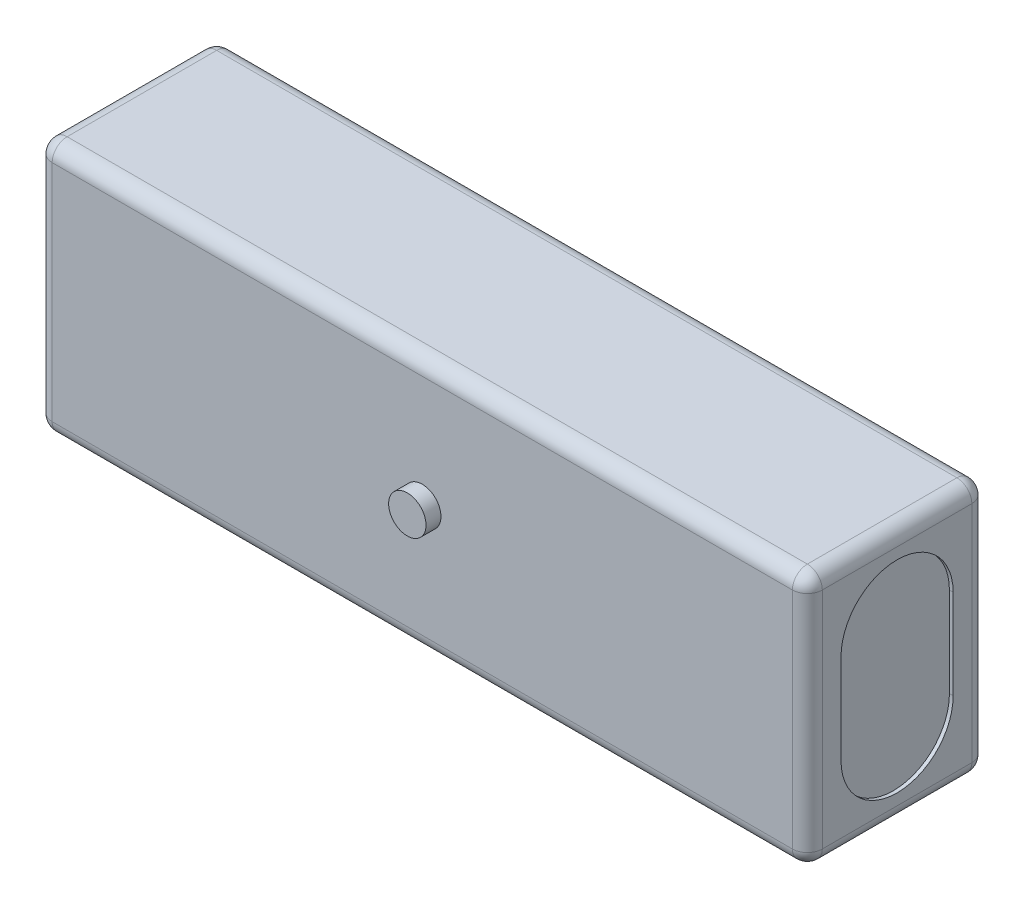
ISO-10303-21;
HEADER;
FILE_DESCRIPTION(('STEP AP214'),'2;1');
FILE_NAME('part.step','',(''),(''),'','','');
FILE_SCHEMA(('AUTOMOTIVE_DESIGN { 1 0 10303 214 1 1 1 1 }'));
ENDSEC;
DATA;
#1=APPLICATION_CONTEXT('core data for automotive mechanical design processes');
#2=APPLICATION_PROTOCOL_DEFINITION('international standard','automotive_design',2000,#1);
#3=PRODUCT_CONTEXT('',#1,'mechanical');
#4=PRODUCT('Part','Part','',(#3));
#5=PRODUCT_RELATED_PRODUCT_CATEGORY('part','',(#4));
#6=PRODUCT_DEFINITION_FORMATION('','',#4);
#7=PRODUCT_DEFINITION_CONTEXT('part definition',#1,'design');
#8=PRODUCT_DEFINITION('design','',#6,#7);
#9=PRODUCT_DEFINITION_SHAPE('','',#8);
#10=(LENGTH_UNIT() NAMED_UNIT(*) SI_UNIT(.MILLI.,.METRE.));
#11=(NAMED_UNIT(*) PLANE_ANGLE_UNIT() SI_UNIT($,.RADIAN.));
#12=(NAMED_UNIT(*) SI_UNIT($,.STERADIAN.) SOLID_ANGLE_UNIT());
#13=UNCERTAINTY_MEASURE_WITH_UNIT(LENGTH_MEASURE(1.E-05),#10,'distance_accuracy_value','');
#14=(GEOMETRIC_REPRESENTATION_CONTEXT(3) GLOBAL_UNCERTAINTY_ASSIGNED_CONTEXT((#13)) GLOBAL_UNIT_ASSIGNED_CONTEXT((#10,
#11,#12)) REPRESENTATION_CONTEXT('',''));
#15=CARTESIAN_POINT('',(0.,0.,0.));
#16=DIRECTION('',(0.,0.,1.));
#17=DIRECTION('',(1.,0.,0.));
#18=AXIS2_PLACEMENT_3D('',#15,#16,#17);
#19=CARTESIAN_POINT('',(-51.5,17.,24.));
#20=DIRECTION('',(1.,0.,0.));
#21=DIRECTION('',(0.,1.,0.));
#22=AXIS2_PLACEMENT_3D('',#19,#20,#21);
#23=PLANE('',#22);
#24=DIRECTION('',(0.,-1.,0.));
#25=VECTOR('',#24,1.);
#26=CARTESIAN_POINT('',(-51.5,17.,2.));
#27=LINE('',#26,#25);
#28=CARTESIAN_POINT('',(-51.5,15.,2.));
#29=VERTEX_POINT('',#28);
#30=CARTESIAN_POINT('',(-51.5,-15.,2.));
#31=VERTEX_POINT('',#30);
#32=EDGE_CURVE('E299',#29,#31,#27,.T.);
#33=ORIENTED_EDGE('',*,*,#32,.T.);
#34=DIRECTION('',(0.,0.,-1.));
#35=VECTOR('',#34,1.);
#36=CARTESIAN_POINT('',(-51.5,-15.,24.));
#37=LINE('',#36,#35);
#38=CARTESIAN_POINT('',(-51.5,-15.,22.));
#39=VERTEX_POINT('',#38);
#40=EDGE_CURVE('E302',#31,#39,#37,.F.);
#41=ORIENTED_EDGE('',*,*,#40,.T.);
#42=DIRECTION('',(0.,-1.,0.));
#43=VECTOR('',#42,1.);
#44=CARTESIAN_POINT('',(-51.5,17.,22.));
#45=LINE('',#44,#43);
#46=CARTESIAN_POINT('',(-51.5,15.,22.));
#47=VERTEX_POINT('',#46);
#48=EDGE_CURVE('E293',#39,#47,#45,.F.);
#49=ORIENTED_EDGE('',*,*,#48,.T.);
#50=DIRECTION('',(0.,0.,-1.));
#51=VECTOR('',#50,1.);
#52=CARTESIAN_POINT('',(-51.5,15.,24.));
#53=LINE('',#52,#51);
#54=EDGE_CURVE('E296',#47,#29,#53,.T.);
#55=ORIENTED_EDGE('',*,*,#54,.T.);
#56=EDGE_LOOP('',(#33,#41,#49,#55));
#57=FACE_BOUND('',#56,.T.);
#58=CARTESIAN_POINT('',(-51.5,6.,12.));
#59=DIRECTION('',(1.,0.,0.));
#60=DIRECTION('',(0.,1.,0.));
#61=AXIS2_PLACEMENT_3D('',#58,#59,#60);
#62=CIRCLE('',#61,7.5);
#63=CARTESIAN_POINT('',(-51.5,6.00000000000001,4.5));
#64=VERTEX_POINT('',#63);
#65=CARTESIAN_POINT('',(-51.5,6.,19.5));
#66=VERTEX_POINT('',#65);
#67=EDGE_CURVE('E200',#64,#66,#62,.T.);
#68=ORIENTED_EDGE('',*,*,#67,.T.);
#69=DIRECTION('',(0.,-1.,0.));
#70=VECTOR('',#69,1.);
#71=CARTESIAN_POINT('',(-51.5,6.,19.5));
#72=LINE('',#71,#70);
#73=CARTESIAN_POINT('',(-51.5,-6.,19.5));
#74=VERTEX_POINT('',#73);
#75=EDGE_CURVE('E206',#66,#74,#72,.T.);
#76=ORIENTED_EDGE('',*,*,#75,.T.);
#77=CARTESIAN_POINT('',(-51.5,-6.,12.));
#78=DIRECTION('',(1.,0.,0.));
#79=DIRECTION('',(0.,1.,0.));
#80=AXIS2_PLACEMENT_3D('',#77,#78,#79);
#81=CIRCLE('',#80,7.5);
#82=CARTESIAN_POINT('',(-51.5,-6.,4.5));
#83=VERTEX_POINT('',#82);
#84=EDGE_CURVE('E210',#74,#83,#81,.T.);
#85=ORIENTED_EDGE('',*,*,#84,.T.);
#86=DIRECTION('',(0.,1.,0.));
#87=VECTOR('',#86,1.);
#88=CARTESIAN_POINT('',(-51.5,6.00000000000001,4.5));
#89=LINE('',#88,#87);
#90=EDGE_CURVE('E222',#83,#64,#89,.T.);
#91=ORIENTED_EDGE('',*,*,#90,.T.);
#92=EDGE_LOOP('',(#68,#76,#85,#91));
#93=FACE_BOUND('',#92,.T.);
#94=ADVANCED_FACE('F41',(#57,#93),#23,.F.);
#95=CARTESIAN_POINT('',(51.5,17.,24.));
#96=DIRECTION('',(-1.,0.,0.));
#97=DIRECTION('',(0.,-1.,0.));
#98=AXIS2_PLACEMENT_3D('',#95,#96,#97);
#99=PLANE('',#98);
#100=DIRECTION('',(0.,1.,0.));
#101=VECTOR('',#100,1.);
#102=CARTESIAN_POINT('',(51.5,-17.,22.));
#103=LINE('',#102,#101);
#104=CARTESIAN_POINT('',(51.5,15.,22.));
#105=VERTEX_POINT('',#104);
#106=CARTESIAN_POINT('',(51.5,-15.,22.));
#107=VERTEX_POINT('',#106);
#108=EDGE_CURVE('E306',#105,#107,#103,.F.);
#109=ORIENTED_EDGE('',*,*,#108,.T.);
#110=DIRECTION('',(0.,0.,-1.));
#111=VECTOR('',#110,1.);
#112=CARTESIAN_POINT('',(51.5,-15.,24.));
#113=LINE('',#112,#111);
#114=CARTESIAN_POINT('',(51.5,-15.,2.));
#115=VERTEX_POINT('',#114);
#116=EDGE_CURVE('E315',#107,#115,#113,.T.);
#117=ORIENTED_EDGE('',*,*,#116,.T.);
#118=DIRECTION('',(0.,1.,0.));
#119=VECTOR('',#118,1.);
#120=CARTESIAN_POINT('',(51.5,17.,2.));
#121=LINE('',#120,#119);
#122=CARTESIAN_POINT('',(51.5,15.,2.));
#123=VERTEX_POINT('',#122);
#124=EDGE_CURVE('E312',#115,#123,#121,.T.);
#125=ORIENTED_EDGE('',*,*,#124,.T.);
#126=DIRECTION('',(0.,0.,-1.));
#127=VECTOR('',#126,1.);
#128=CARTESIAN_POINT('',(51.5,15.,24.));
#129=LINE('',#128,#127);
#130=EDGE_CURVE('E309',#123,#105,#129,.F.);
#131=ORIENTED_EDGE('',*,*,#130,.T.);
#132=EDGE_LOOP('',(#109,#117,#125,#131));
#133=FACE_BOUND('',#132,.T.);
#134=DIRECTION('',(0.,-1.,0.));
#135=VECTOR('',#134,1.);
#136=CARTESIAN_POINT('',(51.5,6.,19.5));
#137=LINE('',#136,#135);
#138=CARTESIAN_POINT('',(51.5,6.,19.5));
#139=VERTEX_POINT('',#138);
#140=CARTESIAN_POINT('',(51.5,-6.,19.5));
#141=VERTEX_POINT('',#140);
#142=EDGE_CURVE('E257',#139,#141,#137,.T.);
#143=ORIENTED_EDGE('',*,*,#142,.F.);
#144=CARTESIAN_POINT('',(51.5,6.,12.));
#145=DIRECTION('',(1.,0.,0.));
#146=DIRECTION('',(0.,1.,0.));
#147=AXIS2_PLACEMENT_3D('',#144,#145,#146);
#148=CIRCLE('',#147,7.5);
#149=CARTESIAN_POINT('',(51.5,6.00000000000001,4.5));
#150=VERTEX_POINT('',#149);
#151=EDGE_CURVE('E231',#150,#139,#148,.T.);
#152=ORIENTED_EDGE('',*,*,#151,.F.);
#153=DIRECTION('',(0.,1.,0.));
#154=VECTOR('',#153,1.);
#155=CARTESIAN_POINT('',(51.5,6.00000000000001,4.5));
#156=LINE('',#155,#154);
#157=CARTESIAN_POINT('',(51.5,-6.,4.5));
#158=VERTEX_POINT('',#157);
#159=EDGE_CURVE('E242',#158,#150,#156,.T.);
#160=ORIENTED_EDGE('',*,*,#159,.F.);
#161=CARTESIAN_POINT('',(51.5,-6.,12.));
#162=DIRECTION('',(1.,0.,0.));
#163=DIRECTION('',(0.,1.,0.));
#164=AXIS2_PLACEMENT_3D('',#161,#162,#163);
#165=CIRCLE('',#164,7.5);
#166=EDGE_CURVE('E261',#141,#158,#165,.T.);
#167=ORIENTED_EDGE('',*,*,#166,.F.);
#168=EDGE_LOOP('',(#143,#152,#160,#167));
#169=FACE_BOUND('',#168,.T.);
#170=ADVANCED_FACE('F480',(#133,#169),#99,.F.);
#171=CARTESIAN_POINT('',(-51.5,17.,24.));
#172=DIRECTION('',(0.,-1.,0.));
#173=DIRECTION('',(0.,0.,-1.));
#174=AXIS2_PLACEMENT_3D('',#171,#172,#173);
#175=PLANE('',#174);
#176=DIRECTION('',(0.,0.,-1.));
#177=VECTOR('',#176,1.);
#178=CARTESIAN_POINT('',(49.5,17.,24.));
#179=LINE('',#178,#177);
#180=CARTESIAN_POINT('',(49.5,17.,22.));
#181=VERTEX_POINT('',#180);
#182=CARTESIAN_POINT('',(49.5,17.,2.));
#183=VERTEX_POINT('',#182);
#184=EDGE_CURVE('E338',#181,#183,#179,.T.);
#185=ORIENTED_EDGE('',*,*,#184,.T.);
#186=DIRECTION('',(-1.,0.,0.));
#187=VECTOR('',#186,1.);
#188=CARTESIAN_POINT('',(-51.5,17.,2.));
#189=LINE('',#188,#187);
#190=CARTESIAN_POINT('',(-49.5,17.,2.));
#191=VERTEX_POINT('',#190);
#192=EDGE_CURVE('E342',#183,#191,#189,.T.);
#193=ORIENTED_EDGE('',*,*,#192,.T.);
#194=DIRECTION('',(0.,0.,-1.));
#195=VECTOR('',#194,1.);
#196=CARTESIAN_POINT('',(-49.5,17.,24.));
#197=LINE('',#196,#195);
#198=CARTESIAN_POINT('',(-49.5,17.,22.));
#199=VERTEX_POINT('',#198);
#200=EDGE_CURVE('E335',#191,#199,#197,.F.);
#201=ORIENTED_EDGE('',*,*,#200,.T.);
#202=DIRECTION('',(-1.,0.,0.));
#203=VECTOR('',#202,1.);
#204=CARTESIAN_POINT('',(51.5,17.,22.));
#205=LINE('',#204,#203);
#206=EDGE_CURVE('E332',#199,#181,#205,.F.);
#207=ORIENTED_EDGE('',*,*,#206,.T.);
#208=EDGE_LOOP('',(#185,#193,#201,#207));
#209=FACE_BOUND('',#208,.T.);
#210=ADVANCED_FACE('F495',(#209),#175,.F.);
#211=CARTESIAN_POINT('',(-51.5,-17.,24.));
#212=DIRECTION('',(0.,1.,0.));
#213=DIRECTION('',(0.,0.,1.));
#214=AXIS2_PLACEMENT_3D('',#211,#212,#213);
#215=PLANE('',#214);
#216=DIRECTION('',(0.,0.,-1.));
#217=VECTOR('',#216,1.);
#218=CARTESIAN_POINT('',(-49.5,-17.,24.));
#219=LINE('',#218,#217);
#220=CARTESIAN_POINT('',(-49.5,-17.,22.));
#221=VERTEX_POINT('',#220);
#222=CARTESIAN_POINT('',(-49.5,-17.,2.));
#223=VERTEX_POINT('',#222);
#224=EDGE_CURVE('E286',#221,#223,#219,.T.);
#225=ORIENTED_EDGE('',*,*,#224,.T.);
#226=DIRECTION('',(1.,0.,0.));
#227=VECTOR('',#226,1.);
#228=CARTESIAN_POINT('',(-51.5,-17.,2.));
#229=LINE('',#228,#227);
#230=CARTESIAN_POINT('',(49.5,-17.,2.));
#231=VERTEX_POINT('',#230);
#232=EDGE_CURVE('E290',#223,#231,#229,.T.);
#233=ORIENTED_EDGE('',*,*,#232,.T.);
#234=DIRECTION('',(0.,0.,-1.));
#235=VECTOR('',#234,1.);
#236=CARTESIAN_POINT('',(49.5,-17.,24.));
#237=LINE('',#236,#235);
#238=CARTESIAN_POINT('',(49.5,-17.,22.));
#239=VERTEX_POINT('',#238);
#240=EDGE_CURVE('E283',#231,#239,#237,.F.);
#241=ORIENTED_EDGE('',*,*,#240,.T.);
#242=DIRECTION('',(1.,0.,0.));
#243=VECTOR('',#242,1.);
#244=CARTESIAN_POINT('',(-51.5,-17.,22.));
#245=LINE('',#244,#243);
#246=EDGE_CURVE('E271',#239,#221,#245,.F.);
#247=ORIENTED_EDGE('',*,*,#246,.T.);
#248=EDGE_LOOP('',(#225,#233,#241,#247));
#249=FACE_BOUND('',#248,.T.);
#250=ADVANCED_FACE('F527',(#249),#215,.F.);
#251=CARTESIAN_POINT('',(0.,0.,24.));
#252=DIRECTION('',(0.,0.,1.));
#253=DIRECTION('',(1.,0.,0.));
#254=AXIS2_PLACEMENT_3D('',#251,#252,#253);
#255=PLANE('',#254);
#256=CARTESIAN_POINT('',(0.,0.,24.));
#257=DIRECTION('',(0.,0.,1.));
#258=DIRECTION('',(1.,0.,0.));
#259=AXIS2_PLACEMENT_3D('',#256,#257,#258);
#260=CIRCLE('',#259,2.5);
#261=CARTESIAN_POINT('',(2.5,0.,24.));
#262=VERTEX_POINT('',#261);
#263=EDGE_CURVE('E213',#262,#262,#260,.T.);
#264=ORIENTED_EDGE('',*,*,#263,.F.);
#265=EDGE_LOOP('',(#264));
#266=FACE_BOUND('',#265,.T.);
#267=DIRECTION('',(0.,-1.,0.));
#268=VECTOR('',#267,1.);
#269=CARTESIAN_POINT('',(-49.5,-17.,24.));
#270=LINE('',#269,#268);
#271=CARTESIAN_POINT('',(-49.5,15.,24.));
#272=VERTEX_POINT('',#271);
#273=CARTESIAN_POINT('',(-49.5,-15.,24.));
#274=VERTEX_POINT('',#273);
#275=EDGE_CURVE('E51',#272,#274,#270,.T.);
#276=ORIENTED_EDGE('',*,*,#275,.T.);
#277=DIRECTION('',(1.,0.,0.));
#278=VECTOR('',#277,1.);
#279=CARTESIAN_POINT('',(51.5,-15.,24.));
#280=LINE('',#279,#278);
#281=CARTESIAN_POINT('',(49.5,-15.,24.));
#282=VERTEX_POINT('',#281);
#283=EDGE_CURVE('E11',#274,#282,#280,.T.);
#284=ORIENTED_EDGE('',*,*,#283,.T.);
#285=DIRECTION('',(0.,1.,0.));
#286=VECTOR('',#285,1.);
#287=CARTESIAN_POINT('',(49.5,17.,24.));
#288=LINE('',#287,#286);
#289=CARTESIAN_POINT('',(49.5,15.,24.));
#290=VERTEX_POINT('',#289);
#291=EDGE_CURVE('E345',#282,#290,#288,.T.);
#292=ORIENTED_EDGE('',*,*,#291,.T.);
#293=DIRECTION('',(-1.,0.,0.));
#294=VECTOR('',#293,1.);
#295=CARTESIAN_POINT('',(-51.5,15.,24.));
#296=LINE('',#295,#294);
#297=EDGE_CURVE('E62',#290,#272,#296,.T.);
#298=ORIENTED_EDGE('',*,*,#297,.T.);
#299=EDGE_LOOP('',(#276,#284,#292,#298));
#300=FACE_BOUND('',#299,.T.);
#301=ADVANCED_FACE('F473',(#266,#300),#255,.T.);
#302=CARTESIAN_POINT('',(0.,0.,0.));
#303=DIRECTION('',(0.,0.,1.));
#304=DIRECTION('',(1.,0.,0.));
#305=AXIS2_PLACEMENT_3D('',#302,#303,#304);
#306=PLANE('',#305);
#307=DIRECTION('',(1.,0.,0.));
#308=VECTOR('',#307,1.);
#309=CARTESIAN_POINT('',(0.,-15.,0.));
#310=LINE('',#309,#308);
#311=CARTESIAN_POINT('',(49.5,-15.,0.));
#312=VERTEX_POINT('',#311);
#313=CARTESIAN_POINT('',(-49.5,-15.,0.));
#314=VERTEX_POINT('',#313);
#315=EDGE_CURVE('E325',#312,#314,#310,.F.);
#316=ORIENTED_EDGE('',*,*,#315,.T.);
#317=DIRECTION('',(0.,-1.,0.));
#318=VECTOR('',#317,1.);
#319=CARTESIAN_POINT('',(-49.5,0.,0.));
#320=LINE('',#319,#318);
#321=CARTESIAN_POINT('',(-49.5,15.,0.));
#322=VERTEX_POINT('',#321);
#323=EDGE_CURVE('E328',#314,#322,#320,.F.);
#324=ORIENTED_EDGE('',*,*,#323,.T.);
#325=DIRECTION('',(-1.,0.,0.));
#326=VECTOR('',#325,1.);
#327=CARTESIAN_POINT('',(0.,15.,0.));
#328=LINE('',#327,#326);
#329=CARTESIAN_POINT('',(49.5,15.,0.));
#330=VERTEX_POINT('',#329);
#331=EDGE_CURVE('E319',#322,#330,#328,.F.);
#332=ORIENTED_EDGE('',*,*,#331,.T.);
#333=DIRECTION('',(0.,1.,0.));
#334=VECTOR('',#333,1.);
#335=CARTESIAN_POINT('',(49.5,0.,0.));
#336=LINE('',#335,#334);
#337=EDGE_CURVE('E322',#330,#312,#336,.F.);
#338=ORIENTED_EDGE('',*,*,#337,.T.);
#339=EDGE_LOOP('',(#316,#324,#332,#338));
#340=FACE_BOUND('',#339,.T.);
#341=ADVANCED_FACE('F535',(#340),#306,.F.);
#342=CARTESIAN_POINT('',(51.,6.,12.));
#343=DIRECTION('',(1.,0.,0.));
#344=DIRECTION('',(0.,1.,0.));
#345=AXIS2_PLACEMENT_3D('',#342,#343,#344);
#346=CYLINDRICAL_SURFACE('',#345,7.5);
#347=ORIENTED_EDGE('',*,*,#151,.T.);
#348=DIRECTION('',(1.,0.,0.));
#349=VECTOR('',#348,1.);
#350=CARTESIAN_POINT('',(51.,6.,19.5));
#351=LINE('',#350,#349);
#352=CARTESIAN_POINT('',(51.,6.,19.5));
#353=VERTEX_POINT('',#352);
#354=EDGE_CURVE('E254',#353,#139,#351,.T.);
#355=ORIENTED_EDGE('',*,*,#354,.F.);
#356=CARTESIAN_POINT('',(51.,6.,12.));
#357=DIRECTION('',(1.,0.,0.));
#358=DIRECTION('',(0.,1.,0.));
#359=AXIS2_PLACEMENT_3D('',#356,#357,#358);
#360=CIRCLE('',#359,7.5);
#361=CARTESIAN_POINT('',(51.,6.00000000000001,4.5));
#362=VERTEX_POINT('',#361);
#363=EDGE_CURVE('E237',#362,#353,#360,.T.);
#364=ORIENTED_EDGE('',*,*,#363,.F.);
#365=DIRECTION('',(1.,0.,0.));
#366=VECTOR('',#365,1.);
#367=CARTESIAN_POINT('',(51.,6.00000000000001,4.5));
#368=LINE('',#367,#366);
#369=EDGE_CURVE('E268',#362,#150,#368,.T.);
#370=ORIENTED_EDGE('',*,*,#369,.T.);
#371=EDGE_LOOP('',(#347,#355,#364,#370));
#372=FACE_BOUND('',#371,.T.);
#373=ADVANCED_FACE('F621',(#372),#346,.F.);
#374=CARTESIAN_POINT('',(51.,6.00000000000001,4.5));
#375=DIRECTION('',(0.,0.,-1.));
#376=DIRECTION('',(0.,1.,0.));
#377=AXIS2_PLACEMENT_3D('',#374,#375,#376);
#378=PLANE('',#377);
#379=ORIENTED_EDGE('',*,*,#159,.T.);
#380=ORIENTED_EDGE('',*,*,#369,.F.);
#381=DIRECTION('',(0.,1.,0.));
#382=VECTOR('',#381,1.);
#383=CARTESIAN_POINT('',(51.,6.00000000000001,4.5));
#384=LINE('',#383,#382);
#385=CARTESIAN_POINT('',(51.,-6.,4.5));
#386=VERTEX_POINT('',#385);
#387=EDGE_CURVE('E250',#386,#362,#384,.T.);
#388=ORIENTED_EDGE('',*,*,#387,.F.);
#389=DIRECTION('',(1.,0.,0.));
#390=VECTOR('',#389,1.);
#391=CARTESIAN_POINT('',(51.,-6.,4.5));
#392=LINE('',#391,#390);
#393=EDGE_CURVE('E272',#386,#158,#392,.T.);
#394=ORIENTED_EDGE('',*,*,#393,.T.);
#395=EDGE_LOOP('',(#379,#380,#388,#394));
#396=FACE_BOUND('',#395,.T.);
#397=ADVANCED_FACE('F617',(#396),#378,.F.);
#398=CARTESIAN_POINT('',(51.,-6.,12.));
#399=DIRECTION('',(1.,0.,0.));
#400=DIRECTION('',(0.,1.,0.));
#401=AXIS2_PLACEMENT_3D('',#398,#399,#400);
#402=CYLINDRICAL_SURFACE('',#401,7.5);
#403=ORIENTED_EDGE('',*,*,#166,.T.);
#404=ORIENTED_EDGE('',*,*,#393,.F.);
#405=CARTESIAN_POINT('',(51.,-6.,12.));
#406=DIRECTION('',(1.,0.,0.));
#407=DIRECTION('',(0.,1.,0.));
#408=AXIS2_PLACEMENT_3D('',#405,#406,#407);
#409=CIRCLE('',#408,7.5);
#410=CARTESIAN_POINT('',(51.,-6.,19.5));
#411=VERTEX_POINT('',#410);
#412=EDGE_CURVE('E246',#411,#386,#409,.T.);
#413=ORIENTED_EDGE('',*,*,#412,.F.);
#414=DIRECTION('',(1.,0.,0.));
#415=VECTOR('',#414,1.);
#416=CARTESIAN_POINT('',(51.,-6.,19.5));
#417=LINE('',#416,#415);
#418=EDGE_CURVE('E275',#411,#141,#417,.T.);
#419=ORIENTED_EDGE('',*,*,#418,.T.);
#420=EDGE_LOOP('',(#403,#404,#413,#419));
#421=FACE_BOUND('',#420,.T.);
#422=ADVANCED_FACE('F620',(#421),#402,.F.);
#423=CARTESIAN_POINT('',(51.,6.,19.5));
#424=DIRECTION('',(0.,0.,1.));
#425=DIRECTION('',(0.,-1.,0.));
#426=AXIS2_PLACEMENT_3D('',#423,#424,#425);
#427=PLANE('',#426);
#428=ORIENTED_EDGE('',*,*,#142,.T.);
#429=ORIENTED_EDGE('',*,*,#418,.F.);
#430=DIRECTION('',(0.,-1.,0.));
#431=VECTOR('',#430,1.);
#432=CARTESIAN_POINT('',(51.,6.,19.5));
#433=LINE('',#432,#431);
#434=EDGE_CURVE('E241',#353,#411,#433,.T.);
#435=ORIENTED_EDGE('',*,*,#434,.F.);
#436=ORIENTED_EDGE('',*,*,#354,.T.);
#437=EDGE_LOOP('',(#428,#429,#435,#436));
#438=FACE_BOUND('',#437,.T.);
#439=ADVANCED_FACE('F615',(#438),#427,.F.);
#440=CARTESIAN_POINT('',(51.,6.,12.));
#441=DIRECTION('',(1.,0.,0.));
#442=DIRECTION('',(0.,1.,0.));
#443=AXIS2_PLACEMENT_3D('',#440,#441,#442);
#444=PLANE('',#443);
#445=ORIENTED_EDGE('',*,*,#363,.T.);
#446=ORIENTED_EDGE('',*,*,#434,.T.);
#447=ORIENTED_EDGE('',*,*,#412,.T.);
#448=ORIENTED_EDGE('',*,*,#387,.T.);
#449=EDGE_LOOP('',(#445,#446,#447,#448));
#450=FACE_BOUND('',#449,.T.);
#451=ADVANCED_FACE('F612',(#450),#444,.T.);
#452=CARTESIAN_POINT('',(-51.,6.,12.));
#453=DIRECTION('',(-1.,0.,0.));
#454=DIRECTION('',(0.,-1.,0.));
#455=AXIS2_PLACEMENT_3D('',#452,#453,#454);
#456=CYLINDRICAL_SURFACE('',#455,7.5);
#457=ORIENTED_EDGE('',*,*,#67,.F.);
#458=DIRECTION('',(-1.,0.,0.));
#459=VECTOR('',#458,1.);
#460=CARTESIAN_POINT('',(-51.,6.00000000000001,4.5));
#461=LINE('',#460,#459);
#462=CARTESIAN_POINT('',(-51.,6.00000000000001,4.5));
#463=VERTEX_POINT('',#462);
#464=EDGE_CURVE('E184',#463,#64,#461,.T.);
#465=ORIENTED_EDGE('',*,*,#464,.F.);
#466=CARTESIAN_POINT('',(-51.,6.,12.));
#467=DIRECTION('',(1.,0.,0.));
#468=DIRECTION('',(0.,1.,0.));
#469=AXIS2_PLACEMENT_3D('',#466,#467,#468);
#470=CIRCLE('',#469,7.5);
#471=CARTESIAN_POINT('',(-51.,6.,19.5));
#472=VERTEX_POINT('',#471);
#473=EDGE_CURVE('E192',#463,#472,#470,.T.);
#474=ORIENTED_EDGE('',*,*,#473,.T.);
#475=DIRECTION('',(-1.,0.,0.));
#476=VECTOR('',#475,1.);
#477=CARTESIAN_POINT('',(-51.,6.,19.5));
#478=LINE('',#477,#476);
#479=EDGE_CURVE('E228',#472,#66,#478,.T.);
#480=ORIENTED_EDGE('',*,*,#479,.T.);
#481=EDGE_LOOP('',(#457,#465,#474,#480));
#482=FACE_BOUND('',#481,.T.);
#483=ADVANCED_FACE('F196',(#482),#456,.F.);
#484=CARTESIAN_POINT('',(-51.,6.,19.5));
#485=DIRECTION('',(0.,0.,-1.));
#486=DIRECTION('',(0.,1.,0.));
#487=AXIS2_PLACEMENT_3D('',#484,#485,#486);
#488=PLANE('',#487);
#489=ORIENTED_EDGE('',*,*,#75,.F.);
#490=ORIENTED_EDGE('',*,*,#479,.F.);
#491=DIRECTION('',(0.,-1.,0.));
#492=VECTOR('',#491,1.);
#493=CARTESIAN_POINT('',(-51.,6.,19.5));
#494=LINE('',#493,#492);
#495=CARTESIAN_POINT('',(-51.,-6.,19.5));
#496=VERTEX_POINT('',#495);
#497=EDGE_CURVE('E202',#472,#496,#494,.T.);
#498=ORIENTED_EDGE('',*,*,#497,.T.);
#499=DIRECTION('',(-1.,0.,0.));
#500=VECTOR('',#499,1.);
#501=CARTESIAN_POINT('',(-51.,-6.,19.5));
#502=LINE('',#501,#500);
#503=EDGE_CURVE('E232',#496,#74,#502,.T.);
#504=ORIENTED_EDGE('',*,*,#503,.T.);
#505=EDGE_LOOP('',(#489,#490,#498,#504));
#506=FACE_BOUND('',#505,.T.);
#507=ADVANCED_FACE('F603',(#506),#488,.T.);
#508=CARTESIAN_POINT('',(-51.,-6.,12.));
#509=DIRECTION('',(-1.,0.,0.));
#510=DIRECTION('',(0.,-1.,0.));
#511=AXIS2_PLACEMENT_3D('',#508,#509,#510);
#512=CYLINDRICAL_SURFACE('',#511,7.5);
#513=ORIENTED_EDGE('',*,*,#84,.F.);
#514=ORIENTED_EDGE('',*,*,#503,.F.);
#515=CARTESIAN_POINT('',(-51.,-6.,12.));
#516=DIRECTION('',(1.,0.,0.));
#517=DIRECTION('',(0.,1.,0.));
#518=AXIS2_PLACEMENT_3D('',#515,#516,#517);
#519=CIRCLE('',#518,7.5);
#520=CARTESIAN_POINT('',(-51.,-6.,4.5));
#521=VERTEX_POINT('',#520);
#522=EDGE_CURVE('E191',#496,#521,#519,.T.);
#523=ORIENTED_EDGE('',*,*,#522,.T.);
#524=DIRECTION('',(-1.,0.,0.));
#525=VECTOR('',#524,1.);
#526=CARTESIAN_POINT('',(-51.,-6.,4.5));
#527=LINE('',#526,#525);
#528=EDGE_CURVE('E186',#521,#83,#527,.T.);
#529=ORIENTED_EDGE('',*,*,#528,.T.);
#530=EDGE_LOOP('',(#513,#514,#523,#529));
#531=FACE_BOUND('',#530,.T.);
#532=ADVANCED_FACE('F598',(#531),#512,.F.);
#533=CARTESIAN_POINT('',(-51.,6.00000000000001,4.5));
#534=DIRECTION('',(0.,0.,1.));
#535=DIRECTION('',(0.,-1.,0.));
#536=AXIS2_PLACEMENT_3D('',#533,#534,#535);
#537=PLANE('',#536);
#538=ORIENTED_EDGE('',*,*,#90,.F.);
#539=ORIENTED_EDGE('',*,*,#528,.F.);
#540=DIRECTION('',(0.,1.,0.));
#541=VECTOR('',#540,1.);
#542=CARTESIAN_POINT('',(-51.,6.00000000000001,4.5));
#543=LINE('',#542,#541);
#544=EDGE_CURVE('E180',#521,#463,#543,.T.);
#545=ORIENTED_EDGE('',*,*,#544,.T.);
#546=ORIENTED_EDGE('',*,*,#464,.T.);
#547=EDGE_LOOP('',(#538,#539,#545,#546));
#548=FACE_BOUND('',#547,.T.);
#549=ADVANCED_FACE('F183',(#548),#537,.T.);
#550=CARTESIAN_POINT('',(-51.,6.,12.));
#551=DIRECTION('',(-1.,0.,0.));
#552=DIRECTION('',(0.,1.,0.));
#553=AXIS2_PLACEMENT_3D('',#550,#551,#552);
#554=PLANE('',#553);
#555=ORIENTED_EDGE('',*,*,#473,.F.);
#556=ORIENTED_EDGE('',*,*,#544,.F.);
#557=ORIENTED_EDGE('',*,*,#522,.F.);
#558=ORIENTED_EDGE('',*,*,#497,.F.);
#559=EDGE_LOOP('',(#555,#556,#557,#558));
#560=FACE_BOUND('',#559,.T.);
#561=ADVANCED_FACE('F204',(#560),#554,.T.);
#562=CARTESIAN_POINT('',(49.5,15.,24.));
#563=DIRECTION('',(0.,0.,-1.));
#564=DIRECTION('',(-1.,0.,0.));
#565=AXIS2_PLACEMENT_3D('',#562,#563,#564);
#566=CYLINDRICAL_SURFACE('',#565,2.);
#567=CARTESIAN_POINT('',(49.5,15.,22.));
#568=DIRECTION('',(0.,0.,1.));
#569=DIRECTION('',(1.,0.,0.));
#570=AXIS2_PLACEMENT_3D('',#567,#568,#569);
#571=CIRCLE('',#570,2.);
#572=EDGE_CURVE('E45',#105,#181,#571,.T.);
#573=ORIENTED_EDGE('',*,*,#572,.F.);
#574=ORIENTED_EDGE('',*,*,#130,.F.);
#575=CARTESIAN_POINT('',(49.5,15.,2.));
#576=DIRECTION('',(0.,0.,-1.));
#577=DIRECTION('',(-1.,0.,0.));
#578=AXIS2_PLACEMENT_3D('',#575,#576,#577);
#579=CIRCLE('',#578,2.);
#580=EDGE_CURVE('E435',#183,#123,#579,.T.);
#581=ORIENTED_EDGE('',*,*,#580,.F.);
#582=ORIENTED_EDGE('',*,*,#184,.F.);
#583=EDGE_LOOP('',(#573,#574,#581,#582));
#584=FACE_BOUND('',#583,.T.);
#585=ADVANCED_FACE('F43',(#584),#566,.T.);
#586=CARTESIAN_POINT('',(49.5,15.,22.));
#587=DIRECTION('',(0.,0.,1.));
#588=DIRECTION('',(1.,0.,0.));
#589=AXIS2_PLACEMENT_3D('',#586,#587,#588);
#590=SPHERICAL_SURFACE('',#589,2.);
#591=CARTESIAN_POINT('',(49.5,15.,22.));
#592=DIRECTION('',(0.,1.,0.));
#593=DIRECTION('',(0.,0.,1.));
#594=AXIS2_PLACEMENT_3D('',#591,#592,#593);
#595=CIRCLE('',#594,2.);
#596=EDGE_CURVE('E428',#105,#290,#595,.F.);
#597=ORIENTED_EDGE('',*,*,#596,.F.);
#598=ORIENTED_EDGE('',*,*,#572,.T.);
#599=CARTESIAN_POINT('',(49.5,15.,22.));
#600=DIRECTION('',(1.,0.,0.));
#601=DIRECTION('',(0.,0.,-1.));
#602=AXIS2_PLACEMENT_3D('',#599,#600,#601);
#603=CIRCLE('',#602,2.);
#604=EDGE_CURVE('E432',#290,#181,#603,.F.);
#605=ORIENTED_EDGE('',*,*,#604,.F.);
#606=EDGE_LOOP('',(#597,#598,#605));
#607=FACE_BOUND('',#606,.T.);
#608=ADVANCED_FACE('F448',(#607),#590,.T.);
#609=CARTESIAN_POINT('',(49.5,15.,2.));
#610=DIRECTION('',(0.,0.,1.));
#611=DIRECTION('',(1.,0.,0.));
#612=AXIS2_PLACEMENT_3D('',#609,#610,#611);
#613=SPHERICAL_SURFACE('',#612,2.);
#614=CARTESIAN_POINT('',(49.5,15.,2.));
#615=DIRECTION('',(1.,0.,0.));
#616=DIRECTION('',(0.,0.,-1.));
#617=AXIS2_PLACEMENT_3D('',#614,#615,#616);
#618=CIRCLE('',#617,2.);
#619=EDGE_CURVE('E420',#183,#330,#618,.F.);
#620=ORIENTED_EDGE('',*,*,#619,.F.);
#621=ORIENTED_EDGE('',*,*,#580,.T.);
#622=CARTESIAN_POINT('',(49.5,15.,2.));
#623=DIRECTION('',(0.,1.,0.));
#624=DIRECTION('',(0.,0.,1.));
#625=AXIS2_PLACEMENT_3D('',#622,#623,#624);
#626=CIRCLE('',#625,2.);
#627=EDGE_CURVE('E424',#330,#123,#626,.F.);
#628=ORIENTED_EDGE('',*,*,#627,.F.);
#629=EDGE_LOOP('',(#620,#621,#628));
#630=FACE_BOUND('',#629,.T.);
#631=ADVANCED_FACE('F585',(#630),#613,.T.);
#632=CARTESIAN_POINT('',(0.,15.,22.));
#633=DIRECTION('',(1.,0.,0.));
#634=DIRECTION('',(0.,0.,-1.));
#635=AXIS2_PLACEMENT_3D('',#632,#633,#634);
#636=CYLINDRICAL_SURFACE('',#635,2.);
#637=ORIENTED_EDGE('',*,*,#604,.T.);
#638=ORIENTED_EDGE('',*,*,#206,.F.);
#639=CARTESIAN_POINT('',(-49.5,15.,22.));
#640=DIRECTION('',(-1.,0.,0.));
#641=DIRECTION('',(0.,0.,1.));
#642=AXIS2_PLACEMENT_3D('',#639,#640,#641);
#643=CIRCLE('',#642,2.);
#644=EDGE_CURVE('E412',#272,#199,#643,.T.);
#645=ORIENTED_EDGE('',*,*,#644,.F.);
#646=ORIENTED_EDGE('',*,*,#297,.F.);
#647=EDGE_LOOP('',(#637,#638,#645,#646));
#648=FACE_BOUND('',#647,.T.);
#649=ADVANCED_FACE('F455',(#648),#636,.T.);
#650=CARTESIAN_POINT('',(49.5,0.,22.));
#651=DIRECTION('',(0.,-1.,0.));
#652=DIRECTION('',(1.,0.,0.));
#653=AXIS2_PLACEMENT_3D('',#650,#651,#652);
#654=CYLINDRICAL_SURFACE('',#653,2.);
#655=ORIENTED_EDGE('',*,*,#596,.T.);
#656=ORIENTED_EDGE('',*,*,#291,.F.);
#657=CARTESIAN_POINT('',(49.5,-15.,22.));
#658=DIRECTION('',(0.,-1.,0.));
#659=DIRECTION('',(0.,0.,-1.));
#660=AXIS2_PLACEMENT_3D('',#657,#658,#659);
#661=CIRCLE('',#660,2.);
#662=EDGE_CURVE('E408',#107,#282,#661,.T.);
#663=ORIENTED_EDGE('',*,*,#662,.F.);
#664=ORIENTED_EDGE('',*,*,#108,.F.);
#665=EDGE_LOOP('',(#655,#656,#663,#664));
#666=FACE_BOUND('',#665,.T.);
#667=ADVANCED_FACE('F477',(#666),#654,.T.);
#668=CARTESIAN_POINT('',(49.5,-15.,24.));
#669=DIRECTION('',(0.,0.,-1.));
#670=DIRECTION('',(-1.,0.,0.));
#671=AXIS2_PLACEMENT_3D('',#668,#669,#670);
#672=CYLINDRICAL_SURFACE('',#671,2.);
#673=CARTESIAN_POINT('',(49.5,-15.,2.));
#674=DIRECTION('',(0.,0.,-1.));
#675=DIRECTION('',(-1.,0.,0.));
#676=AXIS2_PLACEMENT_3D('',#673,#674,#675);
#677=CIRCLE('',#676,2.);
#678=EDGE_CURVE('E400',#115,#231,#677,.T.);
#679=ORIENTED_EDGE('',*,*,#678,.F.);
#680=ORIENTED_EDGE('',*,*,#116,.F.);
#681=CARTESIAN_POINT('',(49.5,-15.,22.));
#682=DIRECTION('',(0.,0.,1.));
#683=DIRECTION('',(1.,0.,0.));
#684=AXIS2_PLACEMENT_3D('',#681,#682,#683);
#685=CIRCLE('',#684,2.);
#686=EDGE_CURVE('E404',#239,#107,#685,.T.);
#687=ORIENTED_EDGE('',*,*,#686,.F.);
#688=ORIENTED_EDGE('',*,*,#240,.F.);
#689=EDGE_LOOP('',(#679,#680,#687,#688));
#690=FACE_BOUND('',#689,.T.);
#691=ADVANCED_FACE('F485',(#690),#672,.T.);
#692=CARTESIAN_POINT('',(49.5,17.,2.));
#693=DIRECTION('',(0.,1.,0.));
#694=DIRECTION('',(-1.,0.,0.));
#695=AXIS2_PLACEMENT_3D('',#692,#693,#694);
#696=CYLINDRICAL_SURFACE('',#695,2.);
#697=ORIENTED_EDGE('',*,*,#627,.T.);
#698=ORIENTED_EDGE('',*,*,#124,.F.);
#699=CARTESIAN_POINT('',(49.5,-15.,2.));
#700=DIRECTION('',(0.,-1.,0.));
#701=DIRECTION('',(1.,0.,0.));
#702=AXIS2_PLACEMENT_3D('',#699,#700,#701);
#703=CIRCLE('',#702,2.);
#704=EDGE_CURVE('E397',#312,#115,#703,.T.);
#705=ORIENTED_EDGE('',*,*,#704,.F.);
#706=ORIENTED_EDGE('',*,*,#337,.F.);
#707=EDGE_LOOP('',(#697,#698,#705,#706));
#708=FACE_BOUND('',#707,.T.);
#709=ADVANCED_FACE('F492',(#708),#696,.T.);
#710=CARTESIAN_POINT('',(-51.5,15.,2.));
#711=DIRECTION('',(-1.,0.,0.));
#712=DIRECTION('',(0.,0.,1.));
#713=AXIS2_PLACEMENT_3D('',#710,#711,#712);
#714=CYLINDRICAL_SURFACE('',#713,2.);
#715=ORIENTED_EDGE('',*,*,#619,.T.);
#716=ORIENTED_EDGE('',*,*,#331,.F.);
#717=CARTESIAN_POINT('',(-49.5,15.,2.));
#718=DIRECTION('',(-1.,0.,0.));
#719=DIRECTION('',(0.,0.,1.));
#720=AXIS2_PLACEMENT_3D('',#717,#718,#719);
#721=CIRCLE('',#720,2.);
#722=EDGE_CURVE('E393',#191,#322,#721,.T.);
#723=ORIENTED_EDGE('',*,*,#722,.F.);
#724=ORIENTED_EDGE('',*,*,#192,.F.);
#725=EDGE_LOOP('',(#715,#716,#723,#724));
#726=FACE_BOUND('',#725,.T.);
#727=ADVANCED_FACE('F505',(#726),#714,.T.);
#728=CARTESIAN_POINT('',(-49.5,15.,24.));
#729=DIRECTION('',(0.,0.,-1.));
#730=DIRECTION('',(-1.,0.,0.));
#731=AXIS2_PLACEMENT_3D('',#728,#729,#730);
#732=CYLINDRICAL_SURFACE('',#731,2.);
#733=CARTESIAN_POINT('',(-49.5,15.,22.));
#734=DIRECTION('',(0.,0.,1.));
#735=DIRECTION('',(1.,0.,0.));
#736=AXIS2_PLACEMENT_3D('',#733,#734,#735);
#737=CIRCLE('',#736,2.);
#738=EDGE_CURVE('E416',#199,#47,#737,.T.);
#739=ORIENTED_EDGE('',*,*,#738,.F.);
#740=ORIENTED_EDGE('',*,*,#200,.F.);
#741=CARTESIAN_POINT('',(-49.5,15.,2.));
#742=DIRECTION('',(0.,0.,-1.));
#743=DIRECTION('',(-1.,0.,0.));
#744=AXIS2_PLACEMENT_3D('',#741,#742,#743);
#745=CIRCLE('',#744,2.);
#746=EDGE_CURVE('E389',#29,#191,#745,.T.);
#747=ORIENTED_EDGE('',*,*,#746,.F.);
#748=ORIENTED_EDGE('',*,*,#54,.F.);
#749=EDGE_LOOP('',(#739,#740,#747,#748));
#750=FACE_BOUND('',#749,.T.);
#751=ADVANCED_FACE('F500',(#750),#732,.T.);
#752=CARTESIAN_POINT('',(-49.5,15.,22.));
#753=DIRECTION('',(0.,0.,1.));
#754=DIRECTION('',(1.,0.,0.));
#755=AXIS2_PLACEMENT_3D('',#752,#753,#754);
#756=SPHERICAL_SURFACE('',#755,2.);
#757=ORIENTED_EDGE('',*,*,#644,.T.);
#758=ORIENTED_EDGE('',*,*,#738,.T.);
#759=CARTESIAN_POINT('',(-49.5,15.,22.));
#760=DIRECTION('',(0.,1.,0.));
#761=DIRECTION('',(0.,0.,1.));
#762=AXIS2_PLACEMENT_3D('',#759,#760,#761);
#763=CIRCLE('',#762,2.);
#764=EDGE_CURVE('E385',#272,#47,#763,.F.);
#765=ORIENTED_EDGE('',*,*,#764,.F.);
#766=EDGE_LOOP('',(#757,#758,#765));
#767=FACE_BOUND('',#766,.T.);
#768=ADVANCED_FACE('F459',(#767),#756,.T.);
#769=CARTESIAN_POINT('',(49.5,-15.,22.));
#770=DIRECTION('',(0.,0.,1.));
#771=DIRECTION('',(1.,0.,0.));
#772=AXIS2_PLACEMENT_3D('',#769,#770,#771);
#773=SPHERICAL_SURFACE('',#772,2.);
#774=ORIENTED_EDGE('',*,*,#686,.T.);
#775=ORIENTED_EDGE('',*,*,#662,.T.);
#776=CARTESIAN_POINT('',(49.5,-15.,22.));
#777=DIRECTION('',(1.,0.,0.));
#778=DIRECTION('',(0.,0.,-1.));
#779=AXIS2_PLACEMENT_3D('',#776,#777,#778);
#780=CIRCLE('',#779,2.);
#781=EDGE_CURVE('E382',#239,#282,#780,.F.);
#782=ORIENTED_EDGE('',*,*,#781,.F.);
#783=EDGE_LOOP('',(#774,#775,#782));
#784=FACE_BOUND('',#783,.T.);
#785=ADVANCED_FACE('F567',(#784),#773,.T.);
#786=CARTESIAN_POINT('',(49.5,-15.,2.));
#787=DIRECTION('',(0.,0.,1.));
#788=DIRECTION('',(1.,0.,0.));
#789=AXIS2_PLACEMENT_3D('',#786,#787,#788);
#790=SPHERICAL_SURFACE('',#789,2.);
#791=ORIENTED_EDGE('',*,*,#704,.T.);
#792=ORIENTED_EDGE('',*,*,#678,.T.);
#793=CARTESIAN_POINT('',(49.5,-15.,2.));
#794=DIRECTION('',(1.,0.,0.));
#795=DIRECTION('',(0.,0.,-1.));
#796=AXIS2_PLACEMENT_3D('',#793,#794,#795);
#797=CIRCLE('',#796,2.);
#798=EDGE_CURVE('E378',#312,#231,#797,.F.);
#799=ORIENTED_EDGE('',*,*,#798,.F.);
#800=EDGE_LOOP('',(#791,#792,#799));
#801=FACE_BOUND('',#800,.T.);
#802=ADVANCED_FACE('F564',(#801),#790,.T.);
#803=CARTESIAN_POINT('',(-49.5,15.,2.));
#804=DIRECTION('',(0.,0.,1.));
#805=DIRECTION('',(1.,0.,0.));
#806=AXIS2_PLACEMENT_3D('',#803,#804,#805);
#807=SPHERICAL_SURFACE('',#806,2.);
#808=ORIENTED_EDGE('',*,*,#746,.T.);
#809=ORIENTED_EDGE('',*,*,#722,.T.);
#810=CARTESIAN_POINT('',(-49.5,15.,2.));
#811=DIRECTION('',(0.,1.,0.));
#812=DIRECTION('',(0.,0.,1.));
#813=AXIS2_PLACEMENT_3D('',#810,#811,#812);
#814=CIRCLE('',#813,2.);
#815=EDGE_CURVE('E375',#29,#322,#814,.F.);
#816=ORIENTED_EDGE('',*,*,#815,.F.);
#817=EDGE_LOOP('',(#808,#809,#816));
#818=FACE_BOUND('',#817,.T.);
#819=ADVANCED_FACE('F507',(#818),#807,.T.);
#820=CARTESIAN_POINT('',(-49.5,0.,22.));
#821=DIRECTION('',(0.,1.,0.));
#822=DIRECTION('',(-1.,0.,0.));
#823=AXIS2_PLACEMENT_3D('',#820,#821,#822);
#824=CYLINDRICAL_SURFACE('',#823,2.);
#825=ORIENTED_EDGE('',*,*,#764,.T.);
#826=ORIENTED_EDGE('',*,*,#48,.F.);
#827=CARTESIAN_POINT('',(-49.5,-15.,22.));
#828=DIRECTION('',(0.,-1.,0.));
#829=DIRECTION('',(0.,0.,-1.));
#830=AXIS2_PLACEMENT_3D('',#827,#828,#829);
#831=CIRCLE('',#830,2.);
#832=EDGE_CURVE('E371',#274,#39,#831,.T.);
#833=ORIENTED_EDGE('',*,*,#832,.F.);
#834=ORIENTED_EDGE('',*,*,#275,.F.);
#835=EDGE_LOOP('',(#825,#826,#833,#834));
#836=FACE_BOUND('',#835,.T.);
#837=ADVANCED_FACE('F463',(#836),#824,.T.);
#838=CARTESIAN_POINT('',(0.,-15.,22.));
#839=DIRECTION('',(-1.,0.,0.));
#840=DIRECTION('',(0.,0.,1.));
#841=AXIS2_PLACEMENT_3D('',#838,#839,#840);
#842=CYLINDRICAL_SURFACE('',#841,2.);
#843=ORIENTED_EDGE('',*,*,#781,.T.);
#844=ORIENTED_EDGE('',*,*,#283,.F.);
#845=CARTESIAN_POINT('',(-49.5,-15.,22.));
#846=DIRECTION('',(-1.,0.,0.));
#847=DIRECTION('',(0.,0.,1.));
#848=AXIS2_PLACEMENT_3D('',#845,#846,#847);
#849=CIRCLE('',#848,2.);
#850=EDGE_CURVE('E367',#221,#274,#849,.T.);
#851=ORIENTED_EDGE('',*,*,#850,.F.);
#852=ORIENTED_EDGE('',*,*,#246,.F.);
#853=EDGE_LOOP('',(#843,#844,#851,#852));
#854=FACE_BOUND('',#853,.T.);
#855=ADVANCED_FACE('F471',(#854),#842,.T.);
#856=CARTESIAN_POINT('',(-51.5,-15.,2.));
#857=DIRECTION('',(1.,0.,0.));
#858=DIRECTION('',(0.,0.,-1.));
#859=AXIS2_PLACEMENT_3D('',#856,#857,#858);
#860=CYLINDRICAL_SURFACE('',#859,2.);
#861=ORIENTED_EDGE('',*,*,#798,.T.);
#862=ORIENTED_EDGE('',*,*,#232,.F.);
#863=CARTESIAN_POINT('',(-49.5,-15.,2.));
#864=DIRECTION('',(-1.,0.,0.));
#865=DIRECTION('',(0.,0.,1.));
#866=AXIS2_PLACEMENT_3D('',#863,#864,#865);
#867=CIRCLE('',#866,2.);
#868=EDGE_CURVE('E363',#314,#223,#867,.T.);
#869=ORIENTED_EDGE('',*,*,#868,.F.);
#870=ORIENTED_EDGE('',*,*,#315,.F.);
#871=EDGE_LOOP('',(#861,#862,#869,#870));
#872=FACE_BOUND('',#871,.T.);
#873=ADVANCED_FACE('F525',(#872),#860,.T.);
#874=CARTESIAN_POINT('',(-49.5,17.,2.));
#875=DIRECTION('',(0.,-1.,0.));
#876=DIRECTION('',(1.,0.,0.));
#877=AXIS2_PLACEMENT_3D('',#874,#875,#876);
#878=CYLINDRICAL_SURFACE('',#877,2.);
#879=ORIENTED_EDGE('',*,*,#815,.T.);
#880=ORIENTED_EDGE('',*,*,#323,.F.);
#881=CARTESIAN_POINT('',(-49.5,-15.,2.));
#882=DIRECTION('',(0.,-1.,0.));
#883=DIRECTION('',(0.,0.,-1.));
#884=AXIS2_PLACEMENT_3D('',#881,#882,#883);
#885=CIRCLE('',#884,2.);
#886=EDGE_CURVE('E359',#31,#314,#885,.T.);
#887=ORIENTED_EDGE('',*,*,#886,.F.);
#888=ORIENTED_EDGE('',*,*,#32,.F.);
#889=EDGE_LOOP('',(#879,#880,#887,#888));
#890=FACE_BOUND('',#889,.T.);
#891=ADVANCED_FACE('F512',(#890),#878,.T.);
#892=CARTESIAN_POINT('',(-49.5,-15.,22.));
#893=DIRECTION('',(0.,0.,1.));
#894=DIRECTION('',(1.,0.,0.));
#895=AXIS2_PLACEMENT_3D('',#892,#893,#894);
#896=SPHERICAL_SURFACE('',#895,2.);
#897=ORIENTED_EDGE('',*,*,#850,.T.);
#898=ORIENTED_EDGE('',*,*,#832,.T.);
#899=CARTESIAN_POINT('',(-49.5,-15.,22.));
#900=DIRECTION('',(0.,0.,1.));
#901=DIRECTION('',(1.,0.,0.));
#902=AXIS2_PLACEMENT_3D('',#899,#900,#901);
#903=CIRCLE('',#902,2.);
#904=EDGE_CURVE('E355',#221,#39,#903,.F.);
#905=ORIENTED_EDGE('',*,*,#904,.F.);
#906=EDGE_LOOP('',(#897,#898,#905));
#907=FACE_BOUND('',#906,.T.);
#908=ADVANCED_FACE('F467',(#907),#896,.T.);
#909=CARTESIAN_POINT('',(-49.5,-15.,2.));
#910=DIRECTION('',(0.,0.,1.));
#911=DIRECTION('',(1.,0.,0.));
#912=AXIS2_PLACEMENT_3D('',#909,#910,#911);
#913=SPHERICAL_SURFACE('',#912,2.);
#914=ORIENTED_EDGE('',*,*,#886,.T.);
#915=ORIENTED_EDGE('',*,*,#868,.T.);
#916=CARTESIAN_POINT('',(-49.5,-15.,2.));
#917=DIRECTION('',(0.,0.,-1.));
#918=DIRECTION('',(-1.,0.,0.));
#919=AXIS2_PLACEMENT_3D('',#916,#917,#918);
#920=CIRCLE('',#919,2.);
#921=EDGE_CURVE('E352',#31,#223,#920,.F.);
#922=ORIENTED_EDGE('',*,*,#921,.F.);
#923=EDGE_LOOP('',(#914,#915,#922));
#924=FACE_BOUND('',#923,.T.);
#925=ADVANCED_FACE('F520',(#924),#913,.T.);
#926=CARTESIAN_POINT('',(-49.5,-15.,24.));
#927=DIRECTION('',(0.,0.,-1.));
#928=DIRECTION('',(-1.,0.,0.));
#929=AXIS2_PLACEMENT_3D('',#926,#927,#928);
#930=CYLINDRICAL_SURFACE('',#929,2.);
#931=ORIENTED_EDGE('',*,*,#904,.T.);
#932=ORIENTED_EDGE('',*,*,#40,.F.);
#933=ORIENTED_EDGE('',*,*,#921,.T.);
#934=ORIENTED_EDGE('',*,*,#224,.F.);
#935=EDGE_LOOP('',(#931,#932,#933,#934));
#936=FACE_BOUND('',#935,.T.);
#937=ADVANCED_FACE('F518',(#936),#930,.T.);
#938=CARTESIAN_POINT('',(0.,0.,26.));
#939=DIRECTION('',(0.,0.,-1.));
#940=DIRECTION('',(-1.,0.,0.));
#941=AXIS2_PLACEMENT_3D('',#938,#939,#940);
#942=CYLINDRICAL_SURFACE('',#941,2.5);
#943=CARTESIAN_POINT('',(0.,0.,26.));
#944=DIRECTION('',(0.,0.,1.));
#945=DIRECTION('',(1.,0.,0.));
#946=AXIS2_PLACEMENT_3D('',#943,#944,#945);
#947=CIRCLE('',#946,2.5);
#948=CARTESIAN_POINT('',(2.5,0.,26.));
#949=VERTEX_POINT('',#948);
#950=EDGE_CURVE('E356',#949,#949,#947,.T.);
#951=ORIENTED_EDGE('',*,*,#950,.F.);
#952=EDGE_LOOP('',(#951));
#953=FACE_BOUND('',#952,.T.);
#954=ORIENTED_EDGE('',*,*,#263,.T.);
#955=EDGE_LOOP('',(#954));
#956=FACE_BOUND('',#955,.T.);
#957=ADVANCED_FACE('F549',(#953,#956),#942,.T.);
#958=CARTESIAN_POINT('',(0.,0.,26.));
#959=DIRECTION('',(0.,0.,1.));
#960=DIRECTION('',(1.,0.,0.));
#961=AXIS2_PLACEMENT_3D('',#958,#959,#960);
#962=PLANE('',#961);
#963=ORIENTED_EDGE('',*,*,#950,.T.);
#964=EDGE_LOOP('',(#963));
#965=FACE_BOUND('',#964,.T.);
#966=ADVANCED_FACE('F830',(#965),#962,.T.);
#967=CLOSED_SHELL('',(#94,#170,#210,#250,#301,#341,#373,#397,#422,#439,#451,#483,#507,#532,#549,
#561,#585,#608,#631,#649,#667,#691,#709,#727,#751,#768,#785,#802,#819,#837,#855,#873,#891,#908,
#925,#937,#957,#966));
#968=MANIFOLD_SOLID_BREP('B2',#967);
#969=ADVANCED_BREP_SHAPE_REPRESENTATION('',(#18,#968),#14);
#970=SHAPE_DEFINITION_REPRESENTATION(#9,#969);
ENDSEC;
END-ISO-10303-21;
